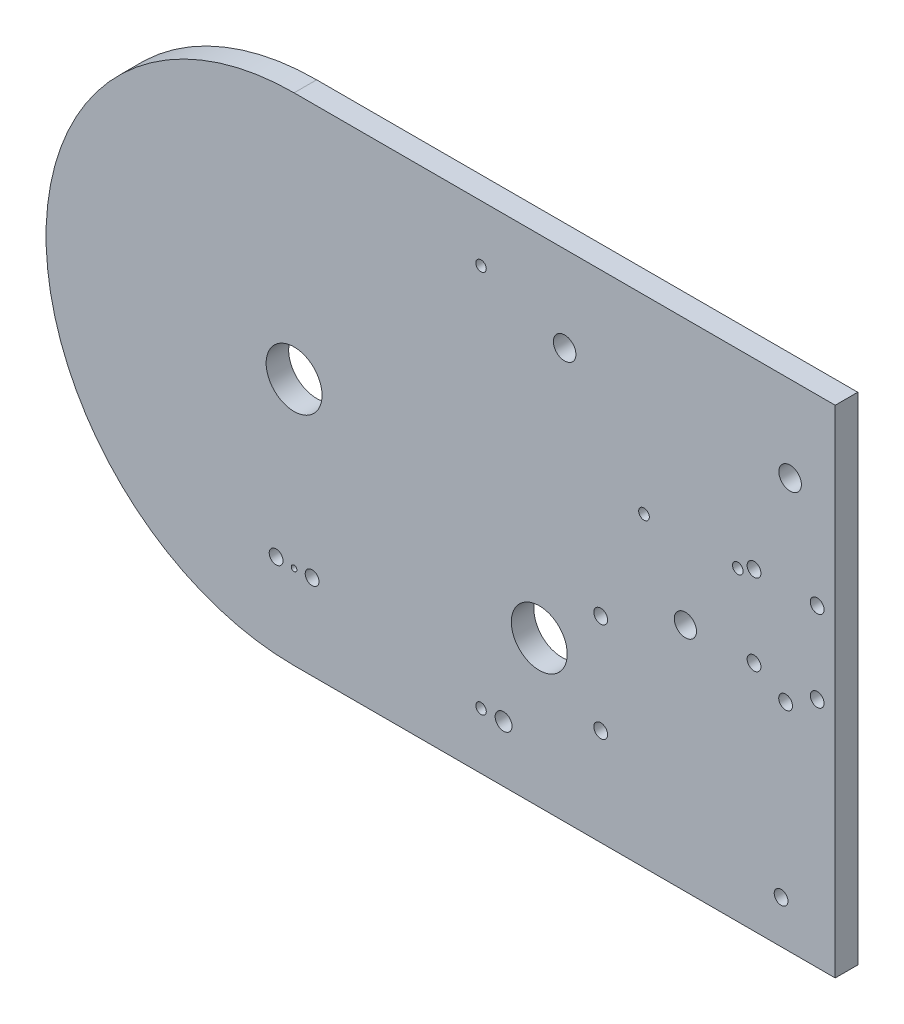
ISO-10303-21;
HEADER;
FILE_DESCRIPTION(('STEP AP214'),'2;1');
FILE_NAME('part.step','',(''),(''),'','','');
FILE_SCHEMA(('AUTOMOTIVE_DESIGN { 1 0 10303 214 1 1 1 1 }'));
ENDSEC;
DATA;
#1=APPLICATION_CONTEXT('core data for automotive mechanical design processes');
#2=APPLICATION_PROTOCOL_DEFINITION('international standard','automotive_design',2000,#1);
#3=PRODUCT_CONTEXT('',#1,'mechanical');
#4=PRODUCT('Part','Part','',(#3));
#5=PRODUCT_RELATED_PRODUCT_CATEGORY('part','',(#4));
#6=PRODUCT_DEFINITION_FORMATION('','',#4);
#7=PRODUCT_DEFINITION_CONTEXT('part definition',#1,'design');
#8=PRODUCT_DEFINITION('design','',#6,#7);
#9=PRODUCT_DEFINITION_SHAPE('','',#8);
#10=(LENGTH_UNIT() NAMED_UNIT(*) SI_UNIT(.MILLI.,.METRE.));
#11=(NAMED_UNIT(*) PLANE_ANGLE_UNIT() SI_UNIT($,.RADIAN.));
#12=(NAMED_UNIT(*) SI_UNIT($,.STERADIAN.) SOLID_ANGLE_UNIT());
#13=UNCERTAINTY_MEASURE_WITH_UNIT(LENGTH_MEASURE(1.E-05),#10,'distance_accuracy_value','');
#14=(GEOMETRIC_REPRESENTATION_CONTEXT(3) GLOBAL_UNCERTAINTY_ASSIGNED_CONTEXT((#13)) GLOBAL_UNIT_ASSIGNED_CONTEXT((#10,
#11,#12)) REPRESENTATION_CONTEXT('',''));
#15=CARTESIAN_POINT('',(0.,0.,0.));
#16=DIRECTION('',(0.,0.,1.));
#17=DIRECTION('',(1.,0.,0.));
#18=AXIS2_PLACEMENT_3D('',#15,#16,#17);
#19=CARTESIAN_POINT('',(0.,0.,6.35));
#20=DIRECTION('',(0.,0.,1.));
#21=DIRECTION('',(1.,0.,0.));
#22=AXIS2_PLACEMENT_3D('',#19,#20,#21);
#23=PLANE('',#22);
#24=CARTESIAN_POINT('',(98.5519999999999,16.382999999999,6.35));
#25=DIRECTION('',(0.,0.,1.));
#26=DIRECTION('',(1.,0.,0.));
#27=AXIS2_PLACEMENT_3D('',#24,#25,#26);
#28=CIRCLE('',#27,1.49859999999999);
#29=CARTESIAN_POINT('',(100.0506,16.382999999999,6.35));
#30=VERTEX_POINT('',#29);
#31=EDGE_CURVE('E233',#30,#30,#28,.T.);
#32=ORIENTED_EDGE('',*,*,#31,.F.);
#33=EDGE_LOOP('',(#32));
#34=FACE_BOUND('',#33,.T.);
#35=CARTESIAN_POINT('',(124.968,16.382999999999,6.35));
#36=DIRECTION('',(0.,0.,1.));
#37=DIRECTION('',(1.,0.,0.));
#38=AXIS2_PLACEMENT_3D('',#35,#36,#37);
#39=CIRCLE('',#38,1.49859999999997);
#40=CARTESIAN_POINT('',(126.4666,16.382999999999,6.35));
#41=VERTEX_POINT('',#40);
#42=EDGE_CURVE('E227',#41,#41,#39,.T.);
#43=ORIENTED_EDGE('',*,*,#42,.F.);
#44=EDGE_LOOP('',(#43));
#45=FACE_BOUND('',#44,.T.);
#46=CARTESIAN_POINT('',(59.0043258396006,-53.975,6.35));
#47=DIRECTION('',(0.,0.,1.));
#48=DIRECTION('',(1.,0.,0.));
#49=AXIS2_PLACEMENT_3D('',#46,#47,#48);
#50=CIRCLE('',#49,2.38125);
#51=CARTESIAN_POINT('',(61.3855758396006,-53.975,6.35));
#52=VERTEX_POINT('',#51);
#53=EDGE_CURVE('E221',#52,#52,#50,.T.);
#54=ORIENTED_EDGE('',*,*,#53,.F.);
#55=EDGE_LOOP('',(#54));
#56=FACE_BOUND('',#55,.T.);
#57=CARTESIAN_POINT('',(0.00594458088814826,-46.140475683147,6.35));
#58=DIRECTION('',(0.,0.,1.));
#59=DIRECTION('',(1.,0.,0.));
#60=AXIS2_PLACEMENT_3D('',#57,#58,#59);
#61=CIRCLE('',#60,0.793749999999994);
#62=CARTESIAN_POINT('',(0.799694580888142,-46.140475683147,6.35));
#63=VERTEX_POINT('',#62);
#64=EDGE_CURVE('E215',#63,#63,#61,.T.);
#65=ORIENTED_EDGE('',*,*,#64,.F.);
#66=EDGE_LOOP('',(#65));
#67=FACE_BOUND('',#66,.T.);
#68=CARTESIAN_POINT('',(129.54,18.414999999999,6.35));
#69=DIRECTION('',(0.,0.,1.));
#70=DIRECTION('',(1.,0.,0.));
#71=AXIS2_PLACEMENT_3D('',#68,#69,#70);
#72=CIRCLE('',#71,1.94309999999998);
#73=CARTESIAN_POINT('',(131.4831,18.414999999999,6.35));
#74=VERTEX_POINT('',#73);
#75=EDGE_CURVE('E209',#74,#74,#72,.T.);
#76=ORIENTED_EDGE('',*,*,#75,.F.);
#77=EDGE_LOOP('',(#76));
#78=FACE_BOUND('',#77,.T.);
#79=CARTESIAN_POINT('',(147.32,18.414999999999,6.35));
#80=DIRECTION('',(0.,0.,1.));
#81=DIRECTION('',(1.,0.,0.));
#82=AXIS2_PLACEMENT_3D('',#79,#80,#81);
#83=CIRCLE('',#82,1.94309999999998);
#84=CARTESIAN_POINT('',(149.2631,18.414999999999,6.35));
#85=VERTEX_POINT('',#84);
#86=EDGE_CURVE('E203',#85,#85,#83,.T.);
#87=ORIENTED_EDGE('',*,*,#86,.F.);
#88=EDGE_LOOP('',(#87));
#89=FACE_BOUND('',#88,.T.);
#90=CARTESIAN_POINT('',(147.32,-4.44500000000105,6.35));
#91=DIRECTION('',(0.,0.,1.));
#92=DIRECTION('',(1.,0.,0.));
#93=AXIS2_PLACEMENT_3D('',#90,#91,#92);
#94=CIRCLE('',#93,1.94309999999998);
#95=CARTESIAN_POINT('',(149.2631,-4.44500000000105,6.35));
#96=VERTEX_POINT('',#95);
#97=EDGE_CURVE('E197',#96,#96,#94,.T.);
#98=ORIENTED_EDGE('',*,*,#97,.F.);
#99=EDGE_LOOP('',(#98));
#100=FACE_BOUND('',#99,.T.);
#101=CARTESIAN_POINT('',(129.54,-4.44500000000096,6.35));
#102=DIRECTION('',(0.,0.,1.));
#103=DIRECTION('',(1.,0.,0.));
#104=AXIS2_PLACEMENT_3D('',#101,#102,#103);
#105=CIRCLE('',#104,1.94309999999998);
#106=CARTESIAN_POINT('',(131.4831,-4.44500000000096,6.35));
#107=VERTEX_POINT('',#106);
#108=EDGE_CURVE('E191',#107,#107,#105,.T.);
#109=ORIENTED_EDGE('',*,*,#108,.F.);
#110=EDGE_LOOP('',(#109));
#111=FACE_BOUND('',#110,.T.);
#112=CARTESIAN_POINT('',(138.43,-9.52500000000096,6.35));
#113=DIRECTION('',(0.,0.,1.));
#114=DIRECTION('',(1.,0.,0.));
#115=AXIS2_PLACEMENT_3D('',#112,#113,#114);
#116=CIRCLE('',#115,1.94309999999998);
#117=CARTESIAN_POINT('',(140.3731,-9.52500000000096,6.35));
#118=VERTEX_POINT('',#117);
#119=EDGE_CURVE('E185',#118,#118,#116,.T.);
#120=ORIENTED_EDGE('',*,*,#119,.F.);
#121=EDGE_LOOP('',(#120));
#122=FACE_BOUND('',#121,.T.);
#123=CARTESIAN_POINT('',(86.3599999999988,-14.6050000000013,6.35));
#124=DIRECTION('',(0.,0.,1.));
#125=DIRECTION('',(1.,0.,0.));
#126=AXIS2_PLACEMENT_3D('',#123,#124,#125);
#127=CIRCLE('',#126,1.94309999999999);
#128=CARTESIAN_POINT('',(88.3030999999988,-14.6050000000013,6.35));
#129=VERTEX_POINT('',#128);
#130=EDGE_CURVE('E179',#129,#129,#127,.T.);
#131=ORIENTED_EDGE('',*,*,#130,.F.);
#132=EDGE_LOOP('',(#131));
#133=FACE_BOUND('',#132,.T.);
#134=CARTESIAN_POINT('',(86.36,-42.5449999999997,6.35));
#135=DIRECTION('',(0.,0.,1.));
#136=DIRECTION('',(1.,0.,0.));
#137=AXIS2_PLACEMENT_3D('',#134,#135,#136);
#138=CIRCLE('',#137,1.94309999999999);
#139=CARTESIAN_POINT('',(88.3031,-42.5449999999997,6.35));
#140=VERTEX_POINT('',#139);
#141=EDGE_CURVE('E173',#140,#140,#138,.T.);
#142=ORIENTED_EDGE('',*,*,#141,.F.);
#143=EDGE_LOOP('',(#142));
#144=FACE_BOUND('',#143,.T.);
#145=CARTESIAN_POINT('',(137.16,-57.785000000001,6.35));
#146=DIRECTION('',(0.,0.,1.));
#147=DIRECTION('',(1.,0.,0.));
#148=AXIS2_PLACEMENT_3D('',#145,#146,#147);
#149=CIRCLE('',#148,1.94309999999998);
#150=CARTESIAN_POINT('',(139.1031,-57.785000000001,6.35));
#151=VERTEX_POINT('',#150);
#152=EDGE_CURVE('E167',#151,#151,#149,.T.);
#153=ORIENTED_EDGE('',*,*,#152,.F.);
#154=EDGE_LOOP('',(#153));
#155=FACE_BOUND('',#154,.T.);
#156=CARTESIAN_POINT('',(5.07324458088815,-45.872975683147,6.35));
#157=DIRECTION('',(0.,0.,1.));
#158=DIRECTION('',(1.,0.,0.));
#159=AXIS2_PLACEMENT_3D('',#156,#157,#158);
#160=CIRCLE('',#159,1.94309999999999);
#161=CARTESIAN_POINT('',(7.01634458088814,-45.872975683147,6.35));
#162=VERTEX_POINT('',#161);
#163=EDGE_CURVE('E161',#162,#162,#160,.T.);
#164=ORIENTED_EDGE('',*,*,#163,.F.);
#165=EDGE_LOOP('',(#164));
#166=FACE_BOUND('',#165,.T.);
#167=CARTESIAN_POINT('',(-5.06135541911185,-45.872975683147,6.35));
#168=DIRECTION('',(0.,0.,1.));
#169=DIRECTION('',(1.,0.,0.));
#170=AXIS2_PLACEMENT_3D('',#167,#168,#169);
#171=CIRCLE('',#170,1.94309999999999);
#172=CARTESIAN_POINT('',(-3.11825541911186,-45.872975683147,6.35));
#173=VERTEX_POINT('',#172);
#174=EDGE_CURVE('E155',#173,#173,#171,.T.);
#175=ORIENTED_EDGE('',*,*,#174,.F.);
#176=EDGE_LOOP('',(#175));
#177=FACE_BOUND('',#176,.T.);
#178=CARTESIAN_POINT('',(52.6543258396006,53.9749999999996,6.35));
#179=DIRECTION('',(0.,0.,1.));
#180=DIRECTION('',(1.,0.,0.));
#181=AXIS2_PLACEMENT_3D('',#178,#179,#180);
#182=CIRCLE('',#181,1.47319999999999);
#183=CARTESIAN_POINT('',(54.1275258396006,53.9749999999996,6.35));
#184=VERTEX_POINT('',#183);
#185=EDGE_CURVE('E149',#184,#184,#182,.T.);
#186=ORIENTED_EDGE('',*,*,#185,.F.);
#187=EDGE_LOOP('',(#186));
#188=FACE_BOUND('',#187,.T.);
#189=CARTESIAN_POINT('',(52.6543258396006,-53.975,6.35));
#190=DIRECTION('',(0.,0.,1.));
#191=DIRECTION('',(1.,0.,0.));
#192=AXIS2_PLACEMENT_3D('',#189,#190,#191);
#193=CIRCLE('',#192,1.47319999999999);
#194=CARTESIAN_POINT('',(54.1275258396006,-53.975,6.35));
#195=VERTEX_POINT('',#194);
#196=EDGE_CURVE('E143',#195,#195,#193,.T.);
#197=ORIENTED_EDGE('',*,*,#196,.F.);
#198=EDGE_LOOP('',(#197));
#199=FACE_BOUND('',#198,.T.);
#200=CARTESIAN_POINT('',(110.206805807524,-4.84362133423188,6.35));
#201=DIRECTION('',(0.,0.,1.));
#202=DIRECTION('',(1.,0.,0.));
#203=AXIS2_PLACEMENT_3D('',#200,#201,#202);
#204=CIRCLE('',#203,3.12699999999998);
#205=CARTESIAN_POINT('',(113.333805807524,-4.84362133423188,6.35));
#206=VERTEX_POINT('',#205);
#207=EDGE_CURVE('E137',#206,#206,#204,.T.);
#208=ORIENTED_EDGE('',*,*,#207,.F.);
#209=EDGE_LOOP('',(#208));
#210=FACE_BOUND('',#209,.T.);
#211=CARTESIAN_POINT('',(139.7,45.72,6.35));
#212=DIRECTION('',(0.,0.,1.));
#213=DIRECTION('',(1.,0.,0.));
#214=AXIS2_PLACEMENT_3D('',#211,#212,#213);
#215=CIRCLE('',#214,3.17499999999997);
#216=CARTESIAN_POINT('',(142.875,45.72,6.35));
#217=VERTEX_POINT('',#216);
#218=EDGE_CURVE('E131',#217,#217,#215,.T.);
#219=ORIENTED_EDGE('',*,*,#218,.F.);
#220=EDGE_LOOP('',(#219));
#221=FACE_BOUND('',#220,.T.);
#222=CARTESIAN_POINT('',(76.2,45.72,6.35));
#223=DIRECTION('',(0.,0.,1.));
#224=DIRECTION('',(1.,0.,0.));
#225=AXIS2_PLACEMENT_3D('',#222,#223,#224);
#226=CIRCLE('',#225,3.17499999999997);
#227=CARTESIAN_POINT('',(79.375,45.72,6.35));
#228=VERTEX_POINT('',#227);
#229=EDGE_CURVE('E125',#228,#228,#226,.T.);
#230=ORIENTED_EDGE('',*,*,#229,.F.);
#231=EDGE_LOOP('',(#230));
#232=FACE_BOUND('',#231,.T.);
#233=CARTESIAN_POINT('',(69.0541023726346,-28.603145740244,6.35));
#234=DIRECTION('',(0.,0.,1.));
#235=DIRECTION('',(1.,0.,0.));
#236=AXIS2_PLACEMENT_3D('',#233,#234,#235);
#237=CIRCLE('',#236,7.87399999999999);
#238=CARTESIAN_POINT('',(76.9281023726346,-28.603145740244,6.35));
#239=VERTEX_POINT('',#238);
#240=EDGE_CURVE('E99',#239,#239,#237,.T.);
#241=ORIENTED_EDGE('',*,*,#240,.F.);
#242=EDGE_LOOP('',(#241));
#243=FACE_BOUND('',#242,.T.);
#244=CARTESIAN_POINT('',(0.,0.,6.35));
#245=DIRECTION('',(0.,0.,1.));
#246=DIRECTION('',(1.,0.,0.));
#247=AXIS2_PLACEMENT_3D('',#244,#245,#246);
#248=CIRCLE('',#247,69.85);
#249=CARTESIAN_POINT('',(0.,69.85,6.35));
#250=VERTEX_POINT('',#249);
#251=CARTESIAN_POINT('',(0.,-69.85,6.35));
#252=VERTEX_POINT('',#251);
#253=EDGE_CURVE('E84',#250,#252,#248,.T.);
#254=ORIENTED_EDGE('',*,*,#253,.T.);
#255=DIRECTION('',(1.,0.,0.));
#256=VECTOR('',#255,1.);
#257=CARTESIAN_POINT('',(0.,-69.85,6.35));
#258=LINE('',#257,#256);
#259=CARTESIAN_POINT('',(152.4,-69.85,6.35));
#260=VERTEX_POINT('',#259);
#261=EDGE_CURVE('E79',#252,#260,#258,.T.);
#262=ORIENTED_EDGE('',*,*,#261,.T.);
#263=DIRECTION('',(0.,1.,0.));
#264=VECTOR('',#263,1.);
#265=CARTESIAN_POINT('',(152.4,69.85,6.35));
#266=LINE('',#265,#264);
#267=CARTESIAN_POINT('',(152.4,69.85,6.35));
#268=VERTEX_POINT('',#267);
#269=EDGE_CURVE('E82',#260,#268,#266,.T.);
#270=ORIENTED_EDGE('',*,*,#269,.T.);
#271=DIRECTION('',(-1.,0.,0.));
#272=VECTOR('',#271,1.);
#273=CARTESIAN_POINT('',(0.,69.85,6.35));
#274=LINE('',#273,#272);
#275=EDGE_CURVE('E49',#268,#250,#274,.T.);
#276=ORIENTED_EDGE('',*,*,#275,.T.);
#277=EDGE_LOOP('',(#254,#262,#270,#276));
#278=FACE_BOUND('',#277,.T.);
#279=CARTESIAN_POINT('',(0.,0.,6.35));
#280=DIRECTION('',(0.,0.,1.));
#281=DIRECTION('',(1.,0.,0.));
#282=AXIS2_PLACEMENT_3D('',#279,#280,#281);
#283=CIRCLE('',#282,7.874);
#284=CARTESIAN_POINT('',(7.874,0.,6.35));
#285=VERTEX_POINT('',#284);
#286=EDGE_CURVE('E114',#285,#285,#283,.T.);
#287=ORIENTED_EDGE('',*,*,#286,.F.);
#288=EDGE_LOOP('',(#287));
#289=FACE_BOUND('',#288,.T.);
#290=ADVANCED_FACE('F32',(#34,#45,#56,#67,#78,#89,#100,#111,#122,#133,#144,#155,#166,#177,#188,
#199,#210,#221,#232,#243,#278,#289),#23,.T.);
#291=CARTESIAN_POINT('',(0.,0.,0.));
#292=DIRECTION('',(0.,0.,1.));
#293=DIRECTION('',(1.,0.,0.));
#294=AXIS2_PLACEMENT_3D('',#291,#292,#293);
#295=PLANE('',#294);
#296=CARTESIAN_POINT('',(98.5519999999999,16.382999999999,0.));
#297=DIRECTION('',(0.,0.,1.));
#298=DIRECTION('',(1.,0.,0.));
#299=AXIS2_PLACEMENT_3D('',#296,#297,#298);
#300=CIRCLE('',#299,1.4986);
#301=CARTESIAN_POINT('',(100.0506,16.382999999999,0.));
#302=VERTEX_POINT('',#301);
#303=EDGE_CURVE('E230',#302,#302,#300,.T.);
#304=ORIENTED_EDGE('',*,*,#303,.T.);
#305=EDGE_LOOP('',(#304));
#306=FACE_BOUND('',#305,.T.);
#307=CARTESIAN_POINT('',(124.968,16.382999999999,0.));
#308=DIRECTION('',(0.,0.,1.));
#309=DIRECTION('',(1.,0.,0.));
#310=AXIS2_PLACEMENT_3D('',#307,#308,#309);
#311=CIRCLE('',#310,1.49859999999999);
#312=CARTESIAN_POINT('',(126.4666,16.382999999999,0.));
#313=VERTEX_POINT('',#312);
#314=EDGE_CURVE('E224',#313,#313,#311,.T.);
#315=ORIENTED_EDGE('',*,*,#314,.T.);
#316=EDGE_LOOP('',(#315));
#317=FACE_BOUND('',#316,.T.);
#318=CARTESIAN_POINT('',(59.0043258396006,-53.975,0.));
#319=DIRECTION('',(0.,0.,1.));
#320=DIRECTION('',(1.,0.,0.));
#321=AXIS2_PLACEMENT_3D('',#318,#319,#320);
#322=CIRCLE('',#321,2.38125);
#323=CARTESIAN_POINT('',(61.3855758396006,-53.975,0.));
#324=VERTEX_POINT('',#323);
#325=EDGE_CURVE('E218',#324,#324,#322,.F.);
#326=ORIENTED_EDGE('',*,*,#325,.F.);
#327=EDGE_LOOP('',(#326));
#328=FACE_BOUND('',#327,.T.);
#329=CARTESIAN_POINT('',(0.00594458088814826,-46.140475683147,0.));
#330=DIRECTION('',(0.,0.,1.));
#331=DIRECTION('',(1.,0.,0.));
#332=AXIS2_PLACEMENT_3D('',#329,#330,#331);
#333=CIRCLE('',#332,0.793749999999994);
#334=CARTESIAN_POINT('',(0.799694580888142,-46.140475683147,0.));
#335=VERTEX_POINT('',#334);
#336=EDGE_CURVE('E212',#335,#335,#333,.F.);
#337=ORIENTED_EDGE('',*,*,#336,.F.);
#338=EDGE_LOOP('',(#337));
#339=FACE_BOUND('',#338,.T.);
#340=CARTESIAN_POINT('',(129.54,18.414999999999,0.));
#341=DIRECTION('',(0.,0.,1.));
#342=DIRECTION('',(1.,0.,0.));
#343=AXIS2_PLACEMENT_3D('',#340,#341,#342);
#344=CIRCLE('',#343,1.94309999999999);
#345=CARTESIAN_POINT('',(131.4831,18.414999999999,0.));
#346=VERTEX_POINT('',#345);
#347=EDGE_CURVE('E206',#346,#346,#344,.T.);
#348=ORIENTED_EDGE('',*,*,#347,.T.);
#349=EDGE_LOOP('',(#348));
#350=FACE_BOUND('',#349,.T.);
#351=CARTESIAN_POINT('',(147.32,18.414999999999,0.));
#352=DIRECTION('',(0.,0.,1.));
#353=DIRECTION('',(1.,0.,0.));
#354=AXIS2_PLACEMENT_3D('',#351,#352,#353);
#355=CIRCLE('',#354,1.94309999999999);
#356=CARTESIAN_POINT('',(149.2631,18.414999999999,0.));
#357=VERTEX_POINT('',#356);
#358=EDGE_CURVE('E200',#357,#357,#355,.T.);
#359=ORIENTED_EDGE('',*,*,#358,.T.);
#360=EDGE_LOOP('',(#359));
#361=FACE_BOUND('',#360,.T.);
#362=CARTESIAN_POINT('',(147.32,-4.44500000000105,0.));
#363=DIRECTION('',(0.,0.,1.));
#364=DIRECTION('',(1.,0.,0.));
#365=AXIS2_PLACEMENT_3D('',#362,#363,#364);
#366=CIRCLE('',#365,1.94309999999999);
#367=CARTESIAN_POINT('',(149.2631,-4.44500000000105,0.));
#368=VERTEX_POINT('',#367);
#369=EDGE_CURVE('E194',#368,#368,#366,.T.);
#370=ORIENTED_EDGE('',*,*,#369,.T.);
#371=EDGE_LOOP('',(#370));
#372=FACE_BOUND('',#371,.T.);
#373=CARTESIAN_POINT('',(129.54,-4.44500000000096,0.));
#374=DIRECTION('',(0.,0.,1.));
#375=DIRECTION('',(1.,0.,0.));
#376=AXIS2_PLACEMENT_3D('',#373,#374,#375);
#377=CIRCLE('',#376,1.94309999999999);
#378=CARTESIAN_POINT('',(131.4831,-4.44500000000096,0.));
#379=VERTEX_POINT('',#378);
#380=EDGE_CURVE('E188',#379,#379,#377,.T.);
#381=ORIENTED_EDGE('',*,*,#380,.T.);
#382=EDGE_LOOP('',(#381));
#383=FACE_BOUND('',#382,.T.);
#384=CARTESIAN_POINT('',(138.43,-9.52500000000096,0.));
#385=DIRECTION('',(0.,0.,1.));
#386=DIRECTION('',(1.,0.,0.));
#387=AXIS2_PLACEMENT_3D('',#384,#385,#386);
#388=CIRCLE('',#387,1.94309999999999);
#389=CARTESIAN_POINT('',(140.3731,-9.52500000000096,0.));
#390=VERTEX_POINT('',#389);
#391=EDGE_CURVE('E182',#390,#390,#388,.T.);
#392=ORIENTED_EDGE('',*,*,#391,.T.);
#393=EDGE_LOOP('',(#392));
#394=FACE_BOUND('',#393,.T.);
#395=CARTESIAN_POINT('',(86.3599999999988,-14.6050000000013,0.));
#396=DIRECTION('',(0.,0.,1.));
#397=DIRECTION('',(1.,0.,0.));
#398=AXIS2_PLACEMENT_3D('',#395,#396,#397);
#399=CIRCLE('',#398,1.9431);
#400=CARTESIAN_POINT('',(88.3030999999988,-14.6050000000013,0.));
#401=VERTEX_POINT('',#400);
#402=EDGE_CURVE('E176',#401,#401,#399,.T.);
#403=ORIENTED_EDGE('',*,*,#402,.T.);
#404=EDGE_LOOP('',(#403));
#405=FACE_BOUND('',#404,.T.);
#406=CARTESIAN_POINT('',(86.36,-42.5449999999997,0.));
#407=DIRECTION('',(0.,0.,1.));
#408=DIRECTION('',(1.,0.,0.));
#409=AXIS2_PLACEMENT_3D('',#406,#407,#408);
#410=CIRCLE('',#409,1.9431);
#411=CARTESIAN_POINT('',(88.3031,-42.5449999999997,0.));
#412=VERTEX_POINT('',#411);
#413=EDGE_CURVE('E170',#412,#412,#410,.T.);
#414=ORIENTED_EDGE('',*,*,#413,.T.);
#415=EDGE_LOOP('',(#414));
#416=FACE_BOUND('',#415,.T.);
#417=CARTESIAN_POINT('',(137.16,-57.785000000001,0.));
#418=DIRECTION('',(0.,0.,1.));
#419=DIRECTION('',(1.,0.,0.));
#420=AXIS2_PLACEMENT_3D('',#417,#418,#419);
#421=CIRCLE('',#420,1.94309999999999);
#422=CARTESIAN_POINT('',(139.1031,-57.785000000001,0.));
#423=VERTEX_POINT('',#422);
#424=EDGE_CURVE('E164',#423,#423,#421,.T.);
#425=ORIENTED_EDGE('',*,*,#424,.T.);
#426=EDGE_LOOP('',(#425));
#427=FACE_BOUND('',#426,.T.);
#428=CARTESIAN_POINT('',(5.07324458088815,-45.872975683147,0.));
#429=DIRECTION('',(0.,0.,1.));
#430=DIRECTION('',(1.,0.,0.));
#431=AXIS2_PLACEMENT_3D('',#428,#429,#430);
#432=CIRCLE('',#431,1.94309999999999);
#433=CARTESIAN_POINT('',(7.01634458088815,-45.872975683147,0.));
#434=VERTEX_POINT('',#433);
#435=EDGE_CURVE('E158',#434,#434,#432,.T.);
#436=ORIENTED_EDGE('',*,*,#435,.T.);
#437=EDGE_LOOP('',(#436));
#438=FACE_BOUND('',#437,.T.);
#439=CARTESIAN_POINT('',(-5.06135541911185,-45.872975683147,0.));
#440=DIRECTION('',(0.,0.,1.));
#441=DIRECTION('',(1.,0.,0.));
#442=AXIS2_PLACEMENT_3D('',#439,#440,#441);
#443=CIRCLE('',#442,1.94309999999999);
#444=CARTESIAN_POINT('',(-3.11825541911185,-45.872975683147,0.));
#445=VERTEX_POINT('',#444);
#446=EDGE_CURVE('E152',#445,#445,#443,.T.);
#447=ORIENTED_EDGE('',*,*,#446,.T.);
#448=EDGE_LOOP('',(#447));
#449=FACE_BOUND('',#448,.T.);
#450=CARTESIAN_POINT('',(52.6543258396006,53.9749999999996,0.));
#451=DIRECTION('',(0.,0.,1.));
#452=DIRECTION('',(1.,0.,0.));
#453=AXIS2_PLACEMENT_3D('',#450,#451,#452);
#454=CIRCLE('',#453,1.47319999999999);
#455=CARTESIAN_POINT('',(54.1275258396006,53.9749999999996,0.));
#456=VERTEX_POINT('',#455);
#457=EDGE_CURVE('E146',#456,#456,#454,.T.);
#458=ORIENTED_EDGE('',*,*,#457,.T.);
#459=EDGE_LOOP('',(#458));
#460=FACE_BOUND('',#459,.T.);
#461=CARTESIAN_POINT('',(52.6543258396006,-53.975,0.));
#462=DIRECTION('',(0.,0.,1.));
#463=DIRECTION('',(1.,0.,0.));
#464=AXIS2_PLACEMENT_3D('',#461,#462,#463);
#465=CIRCLE('',#464,1.47319999999999);
#466=CARTESIAN_POINT('',(54.1275258396006,-53.975,0.));
#467=VERTEX_POINT('',#466);
#468=EDGE_CURVE('E140',#467,#467,#465,.T.);
#469=ORIENTED_EDGE('',*,*,#468,.T.);
#470=EDGE_LOOP('',(#469));
#471=FACE_BOUND('',#470,.T.);
#472=CARTESIAN_POINT('',(110.206805807524,-4.84362133423188,0.));
#473=DIRECTION('',(0.,0.,1.));
#474=DIRECTION('',(1.,0.,0.));
#475=AXIS2_PLACEMENT_3D('',#472,#473,#474);
#476=CIRCLE('',#475,3.12699999999998);
#477=CARTESIAN_POINT('',(113.333805807524,-4.84362133423188,0.));
#478=VERTEX_POINT('',#477);
#479=EDGE_CURVE('E134',#478,#478,#476,.F.);
#480=ORIENTED_EDGE('',*,*,#479,.F.);
#481=EDGE_LOOP('',(#480));
#482=FACE_BOUND('',#481,.T.);
#483=CARTESIAN_POINT('',(139.7,45.72,0.));
#484=DIRECTION('',(0.,0.,1.));
#485=DIRECTION('',(1.,0.,0.));
#486=AXIS2_PLACEMENT_3D('',#483,#484,#485);
#487=CIRCLE('',#486,3.17499999999997);
#488=CARTESIAN_POINT('',(142.875,45.72,0.));
#489=VERTEX_POINT('',#488);
#490=EDGE_CURVE('E128',#489,#489,#487,.F.);
#491=ORIENTED_EDGE('',*,*,#490,.F.);
#492=EDGE_LOOP('',(#491));
#493=FACE_BOUND('',#492,.T.);
#494=CARTESIAN_POINT('',(76.2,45.72,0.));
#495=DIRECTION('',(0.,0.,1.));
#496=DIRECTION('',(1.,0.,0.));
#497=AXIS2_PLACEMENT_3D('',#494,#495,#496);
#498=CIRCLE('',#497,3.17499999999997);
#499=CARTESIAN_POINT('',(79.375,45.72,0.));
#500=VERTEX_POINT('',#499);
#501=EDGE_CURVE('E120',#500,#500,#498,.F.);
#502=ORIENTED_EDGE('',*,*,#501,.F.);
#503=EDGE_LOOP('',(#502));
#504=FACE_BOUND('',#503,.T.);
#505=CARTESIAN_POINT('',(69.0541023726346,-28.603145740244,0.));
#506=DIRECTION('',(0.,0.,1.));
#507=DIRECTION('',(1.,0.,0.));
#508=AXIS2_PLACEMENT_3D('',#505,#506,#507);
#509=CIRCLE('',#508,7.87399999999999);
#510=CARTESIAN_POINT('',(76.9281023726346,-28.603145740244,0.));
#511=VERTEX_POINT('',#510);
#512=EDGE_CURVE('E111',#511,#511,#509,.T.);
#513=ORIENTED_EDGE('',*,*,#512,.T.);
#514=EDGE_LOOP('',(#513));
#515=FACE_BOUND('',#514,.T.);
#516=CARTESIAN_POINT('',(0.,0.,0.));
#517=DIRECTION('',(0.,0.,1.));
#518=DIRECTION('',(1.,0.,0.));
#519=AXIS2_PLACEMENT_3D('',#516,#517,#518);
#520=CIRCLE('',#519,69.85);
#521=CARTESIAN_POINT('',(0.,69.85,0.));
#522=VERTEX_POINT('',#521);
#523=CARTESIAN_POINT('',(0.,-69.85,0.));
#524=VERTEX_POINT('',#523);
#525=EDGE_CURVE('E96',#522,#524,#520,.T.);
#526=ORIENTED_EDGE('',*,*,#525,.F.);
#527=DIRECTION('',(-1.,0.,0.));
#528=VECTOR('',#527,1.);
#529=CARTESIAN_POINT('',(0.,69.85,0.));
#530=LINE('',#529,#528);
#531=CARTESIAN_POINT('',(152.4,69.85,0.));
#532=VERTEX_POINT('',#531);
#533=EDGE_CURVE('E72',#532,#522,#530,.T.);
#534=ORIENTED_EDGE('',*,*,#533,.F.);
#535=DIRECTION('',(0.,1.,0.));
#536=VECTOR('',#535,1.);
#537=CARTESIAN_POINT('',(152.4,69.85,0.));
#538=LINE('',#537,#536);
#539=CARTESIAN_POINT('',(152.4,-69.85,0.));
#540=VERTEX_POINT('',#539);
#541=EDGE_CURVE('E66',#540,#532,#538,.T.);
#542=ORIENTED_EDGE('',*,*,#541,.F.);
#543=DIRECTION('',(1.,0.,0.));
#544=VECTOR('',#543,1.);
#545=CARTESIAN_POINT('',(0.,-69.85,0.));
#546=LINE('',#545,#544);
#547=EDGE_CURVE('E88',#524,#540,#546,.T.);
#548=ORIENTED_EDGE('',*,*,#547,.F.);
#549=EDGE_LOOP('',(#526,#534,#542,#548));
#550=FACE_BOUND('',#549,.T.);
#551=CARTESIAN_POINT('',(0.,0.,0.));
#552=DIRECTION('',(0.,0.,1.));
#553=DIRECTION('',(1.,0.,0.));
#554=AXIS2_PLACEMENT_3D('',#551,#552,#553);
#555=CIRCLE('',#554,7.874);
#556=CARTESIAN_POINT('',(7.874,0.,0.));
#557=VERTEX_POINT('',#556);
#558=EDGE_CURVE('E117',#557,#557,#555,.T.);
#559=ORIENTED_EDGE('',*,*,#558,.T.);
#560=EDGE_LOOP('',(#559));
#561=FACE_BOUND('',#560,.T.);
#562=ADVANCED_FACE('F107',(#306,#317,#328,#339,#350,#361,#372,#383,#394,#405,#416,#427,#438,
#449,#460,#471,#482,#493,#504,#515,#550,#561),#295,.F.);
#563=CARTESIAN_POINT('',(0.,0.,6.35));
#564=DIRECTION('',(0.,0.,-1.));
#565=DIRECTION('',(-1.,0.,0.));
#566=AXIS2_PLACEMENT_3D('',#563,#564,#565);
#567=CYLINDRICAL_SURFACE('',#566,69.85);
#568=ORIENTED_EDGE('',*,*,#525,.T.);
#569=DIRECTION('',(0.,0.,-1.));
#570=VECTOR('',#569,1.);
#571=CARTESIAN_POINT('',(0.,-69.85,6.35));
#572=LINE('',#571,#570);
#573=EDGE_CURVE('E11',#252,#524,#572,.T.);
#574=ORIENTED_EDGE('',*,*,#573,.F.);
#575=ORIENTED_EDGE('',*,*,#253,.F.);
#576=DIRECTION('',(0.,0.,-1.));
#577=VECTOR('',#576,1.);
#578=CARTESIAN_POINT('',(0.,69.85,6.35));
#579=LINE('',#578,#577);
#580=EDGE_CURVE('E92',#250,#522,#579,.T.);
#581=ORIENTED_EDGE('',*,*,#580,.T.);
#582=EDGE_LOOP('',(#568,#574,#575,#581));
#583=FACE_BOUND('',#582,.T.);
#584=ADVANCED_FACE('F34',(#583),#567,.T.);
#585=CARTESIAN_POINT('',(0.,-69.85,6.35));
#586=DIRECTION('',(0.,1.,0.));
#587=DIRECTION('',(0.,0.,1.));
#588=AXIS2_PLACEMENT_3D('',#585,#586,#587);
#589=PLANE('',#588);
#590=ORIENTED_EDGE('',*,*,#547,.T.);
#591=DIRECTION('',(0.,0.,-1.));
#592=VECTOR('',#591,1.);
#593=CARTESIAN_POINT('',(152.4,-69.85,6.35));
#594=LINE('',#593,#592);
#595=EDGE_CURVE('E41',#260,#540,#594,.T.);
#596=ORIENTED_EDGE('',*,*,#595,.F.);
#597=ORIENTED_EDGE('',*,*,#261,.F.);
#598=ORIENTED_EDGE('',*,*,#573,.T.);
#599=EDGE_LOOP('',(#590,#596,#597,#598));
#600=FACE_BOUND('',#599,.T.);
#601=ADVANCED_FACE('F87',(#600),#589,.F.);
#602=CARTESIAN_POINT('',(152.4,69.85,6.35));
#603=DIRECTION('',(-1.,0.,0.));
#604=DIRECTION('',(0.,0.,1.));
#605=AXIS2_PLACEMENT_3D('',#602,#603,#604);
#606=PLANE('',#605);
#607=ORIENTED_EDGE('',*,*,#541,.T.);
#608=DIRECTION('',(0.,0.,-1.));
#609=VECTOR('',#608,1.);
#610=CARTESIAN_POINT('',(152.4,69.85,6.35));
#611=LINE('',#610,#609);
#612=EDGE_CURVE('E89',#268,#532,#611,.T.);
#613=ORIENTED_EDGE('',*,*,#612,.F.);
#614=ORIENTED_EDGE('',*,*,#269,.F.);
#615=ORIENTED_EDGE('',*,*,#595,.T.);
#616=EDGE_LOOP('',(#607,#613,#614,#615));
#617=FACE_BOUND('',#616,.T.);
#618=ADVANCED_FACE('F90',(#617),#606,.F.);
#619=CARTESIAN_POINT('',(0.,69.85,6.35));
#620=DIRECTION('',(0.,-1.,0.));
#621=DIRECTION('',(0.,0.,-1.));
#622=AXIS2_PLACEMENT_3D('',#619,#620,#621);
#623=PLANE('',#622);
#624=ORIENTED_EDGE('',*,*,#533,.T.);
#625=ORIENTED_EDGE('',*,*,#580,.F.);
#626=ORIENTED_EDGE('',*,*,#275,.F.);
#627=ORIENTED_EDGE('',*,*,#612,.T.);
#628=EDGE_LOOP('',(#624,#625,#626,#627));
#629=FACE_BOUND('',#628,.T.);
#630=ADVANCED_FACE('F104',(#629),#623,.F.);
#631=CARTESIAN_POINT('',(69.0541023726346,-28.603145740244,6.35));
#632=DIRECTION('',(0.,0.,-1.));
#633=DIRECTION('',(-1.,0.,0.));
#634=AXIS2_PLACEMENT_3D('',#631,#632,#633);
#635=CYLINDRICAL_SURFACE('',#634,7.87399999999999);
#636=ORIENTED_EDGE('',*,*,#240,.T.);
#637=EDGE_LOOP('',(#636));
#638=FACE_BOUND('',#637,.T.);
#639=ORIENTED_EDGE('',*,*,#512,.F.);
#640=EDGE_LOOP('',(#639));
#641=FACE_BOUND('',#640,.T.);
#642=ADVANCED_FACE('F280',(#638,#641),#635,.F.);
#643=CARTESIAN_POINT('',(0.,0.,6.35));
#644=DIRECTION('',(0.,0.,-1.));
#645=DIRECTION('',(-1.,0.,0.));
#646=AXIS2_PLACEMENT_3D('',#643,#644,#645);
#647=CYLINDRICAL_SURFACE('',#646,7.874);
#648=ORIENTED_EDGE('',*,*,#286,.T.);
#649=EDGE_LOOP('',(#648));
#650=FACE_BOUND('',#649,.T.);
#651=ORIENTED_EDGE('',*,*,#558,.F.);
#652=EDGE_LOOP('',(#651));
#653=FACE_BOUND('',#652,.T.);
#654=ADVANCED_FACE('F283',(#650,#653),#647,.F.);
#655=CARTESIAN_POINT('',(76.2,45.72,-0.00100000000000013));
#656=DIRECTION('',(0.,0.,1.));
#657=DIRECTION('',(1.,0.,0.));
#658=AXIS2_PLACEMENT_3D('',#655,#656,#657);
#659=CYLINDRICAL_SURFACE('',#658,3.17499999999997);
#660=ORIENTED_EDGE('',*,*,#229,.T.);
#661=EDGE_LOOP('',(#660));
#662=FACE_BOUND('',#661,.T.);
#663=ORIENTED_EDGE('',*,*,#501,.T.);
#664=EDGE_LOOP('',(#663));
#665=FACE_BOUND('',#664,.T.);
#666=ADVANCED_FACE('F321',(#662,#665),#659,.F.);
#667=CARTESIAN_POINT('',(139.7,45.72,-0.00100000000000013));
#668=DIRECTION('',(0.,0.,1.));
#669=DIRECTION('',(1.,0.,0.));
#670=AXIS2_PLACEMENT_3D('',#667,#668,#669);
#671=CYLINDRICAL_SURFACE('',#670,3.17499999999997);
#672=ORIENTED_EDGE('',*,*,#218,.T.);
#673=EDGE_LOOP('',(#672));
#674=FACE_BOUND('',#673,.T.);
#675=ORIENTED_EDGE('',*,*,#490,.T.);
#676=EDGE_LOOP('',(#675));
#677=FACE_BOUND('',#676,.T.);
#678=ADVANCED_FACE('F329',(#674,#677),#671,.F.);
#679=CARTESIAN_POINT('',(110.206805807524,-4.84362133423188,-0.00100000000000013));
#680=DIRECTION('',(0.,0.,1.));
#681=DIRECTION('',(1.,0.,0.));
#682=AXIS2_PLACEMENT_3D('',#679,#680,#681);
#683=CYLINDRICAL_SURFACE('',#682,3.12699999999998);
#684=ORIENTED_EDGE('',*,*,#207,.T.);
#685=EDGE_LOOP('',(#684));
#686=FACE_BOUND('',#685,.T.);
#687=ORIENTED_EDGE('',*,*,#479,.T.);
#688=EDGE_LOOP('',(#687));
#689=FACE_BOUND('',#688,.T.);
#690=ADVANCED_FACE('F337',(#686,#689),#683,.F.);
#691=CARTESIAN_POINT('',(52.6543258396006,-53.975,6.35));
#692=DIRECTION('',(0.,0.,1.));
#693=DIRECTION('',(1.,0.,0.));
#694=AXIS2_PLACEMENT_3D('',#691,#692,#693);
#695=CYLINDRICAL_SURFACE('',#694,1.47319999999999);
#696=ORIENTED_EDGE('',*,*,#468,.F.);
#697=EDGE_LOOP('',(#696));
#698=FACE_BOUND('',#697,.T.);
#699=ORIENTED_EDGE('',*,*,#196,.T.);
#700=EDGE_LOOP('',(#699));
#701=FACE_BOUND('',#700,.T.);
#702=ADVANCED_FACE('F345',(#698,#701),#695,.F.);
#703=CARTESIAN_POINT('',(52.6543258396006,53.9749999999996,6.35));
#704=DIRECTION('',(0.,0.,1.));
#705=DIRECTION('',(1.,0.,0.));
#706=AXIS2_PLACEMENT_3D('',#703,#704,#705);
#707=CYLINDRICAL_SURFACE('',#706,1.47319999999999);
#708=ORIENTED_EDGE('',*,*,#457,.F.);
#709=EDGE_LOOP('',(#708));
#710=FACE_BOUND('',#709,.T.);
#711=ORIENTED_EDGE('',*,*,#185,.T.);
#712=EDGE_LOOP('',(#711));
#713=FACE_BOUND('',#712,.T.);
#714=ADVANCED_FACE('F353',(#710,#713),#707,.F.);
#715=CARTESIAN_POINT('',(-5.06135541911185,-45.872975683147,6.35));
#716=DIRECTION('',(0.,0.,1.));
#717=DIRECTION('',(1.,0.,0.));
#718=AXIS2_PLACEMENT_3D('',#715,#716,#717);
#719=CYLINDRICAL_SURFACE('',#718,1.94309999999999);
#720=ORIENTED_EDGE('',*,*,#446,.F.);
#721=EDGE_LOOP('',(#720));
#722=FACE_BOUND('',#721,.T.);
#723=ORIENTED_EDGE('',*,*,#174,.T.);
#724=EDGE_LOOP('',(#723));
#725=FACE_BOUND('',#724,.T.);
#726=ADVANCED_FACE('F361',(#722,#725),#719,.F.);
#727=CARTESIAN_POINT('',(5.07324458088815,-45.872975683147,6.35));
#728=DIRECTION('',(0.,0.,1.));
#729=DIRECTION('',(1.,0.,0.));
#730=AXIS2_PLACEMENT_3D('',#727,#728,#729);
#731=CYLINDRICAL_SURFACE('',#730,1.94309999999999);
#732=ORIENTED_EDGE('',*,*,#435,.F.);
#733=EDGE_LOOP('',(#732));
#734=FACE_BOUND('',#733,.T.);
#735=ORIENTED_EDGE('',*,*,#163,.T.);
#736=EDGE_LOOP('',(#735));
#737=FACE_BOUND('',#736,.T.);
#738=ADVANCED_FACE('F369',(#734,#737),#731,.F.);
#739=CARTESIAN_POINT('',(137.16,-57.785000000001,6.35));
#740=DIRECTION('',(0.,0.,1.));
#741=DIRECTION('',(1.,0.,0.));
#742=AXIS2_PLACEMENT_3D('',#739,#740,#741);
#743=CYLINDRICAL_SURFACE('',#742,1.94309999999999);
#744=ORIENTED_EDGE('',*,*,#424,.F.);
#745=EDGE_LOOP('',(#744));
#746=FACE_BOUND('',#745,.T.);
#747=ORIENTED_EDGE('',*,*,#152,.T.);
#748=EDGE_LOOP('',(#747));
#749=FACE_BOUND('',#748,.T.);
#750=ADVANCED_FACE('F377',(#746,#749),#743,.F.);
#751=CARTESIAN_POINT('',(86.36,-42.5449999999997,6.35));
#752=DIRECTION('',(0.,0.,1.));
#753=DIRECTION('',(1.,0.,0.));
#754=AXIS2_PLACEMENT_3D('',#751,#752,#753);
#755=CYLINDRICAL_SURFACE('',#754,1.9431);
#756=ORIENTED_EDGE('',*,*,#413,.F.);
#757=EDGE_LOOP('',(#756));
#758=FACE_BOUND('',#757,.T.);
#759=ORIENTED_EDGE('',*,*,#141,.T.);
#760=EDGE_LOOP('',(#759));
#761=FACE_BOUND('',#760,.T.);
#762=ADVANCED_FACE('F385',(#758,#761),#755,.F.);
#763=CARTESIAN_POINT('',(86.3599999999988,-14.6050000000013,6.35));
#764=DIRECTION('',(0.,0.,1.));
#765=DIRECTION('',(1.,0.,0.));
#766=AXIS2_PLACEMENT_3D('',#763,#764,#765);
#767=CYLINDRICAL_SURFACE('',#766,1.9431);
#768=ORIENTED_EDGE('',*,*,#402,.F.);
#769=EDGE_LOOP('',(#768));
#770=FACE_BOUND('',#769,.T.);
#771=ORIENTED_EDGE('',*,*,#130,.T.);
#772=EDGE_LOOP('',(#771));
#773=FACE_BOUND('',#772,.T.);
#774=ADVANCED_FACE('F393',(#770,#773),#767,.F.);
#775=CARTESIAN_POINT('',(138.43,-9.52500000000096,6.35));
#776=DIRECTION('',(0.,0.,1.));
#777=DIRECTION('',(1.,0.,0.));
#778=AXIS2_PLACEMENT_3D('',#775,#776,#777);
#779=CYLINDRICAL_SURFACE('',#778,1.94309999999999);
#780=ORIENTED_EDGE('',*,*,#391,.F.);
#781=EDGE_LOOP('',(#780));
#782=FACE_BOUND('',#781,.T.);
#783=ORIENTED_EDGE('',*,*,#119,.T.);
#784=EDGE_LOOP('',(#783));
#785=FACE_BOUND('',#784,.T.);
#786=ADVANCED_FACE('F401',(#782,#785),#779,.F.);
#787=CARTESIAN_POINT('',(129.54,-4.44500000000096,6.35));
#788=DIRECTION('',(0.,0.,1.));
#789=DIRECTION('',(1.,0.,0.));
#790=AXIS2_PLACEMENT_3D('',#787,#788,#789);
#791=CYLINDRICAL_SURFACE('',#790,1.94309999999999);
#792=ORIENTED_EDGE('',*,*,#380,.F.);
#793=EDGE_LOOP('',(#792));
#794=FACE_BOUND('',#793,.T.);
#795=ORIENTED_EDGE('',*,*,#108,.T.);
#796=EDGE_LOOP('',(#795));
#797=FACE_BOUND('',#796,.T.);
#798=ADVANCED_FACE('F409',(#794,#797),#791,.F.);
#799=CARTESIAN_POINT('',(147.32,-4.44500000000105,6.35));
#800=DIRECTION('',(0.,0.,1.));
#801=DIRECTION('',(1.,0.,0.));
#802=AXIS2_PLACEMENT_3D('',#799,#800,#801);
#803=CYLINDRICAL_SURFACE('',#802,1.94309999999999);
#804=ORIENTED_EDGE('',*,*,#369,.F.);
#805=EDGE_LOOP('',(#804));
#806=FACE_BOUND('',#805,.T.);
#807=ORIENTED_EDGE('',*,*,#97,.T.);
#808=EDGE_LOOP('',(#807));
#809=FACE_BOUND('',#808,.T.);
#810=ADVANCED_FACE('F417',(#806,#809),#803,.F.);
#811=CARTESIAN_POINT('',(147.32,18.414999999999,6.35));
#812=DIRECTION('',(0.,0.,1.));
#813=DIRECTION('',(1.,0.,0.));
#814=AXIS2_PLACEMENT_3D('',#811,#812,#813);
#815=CYLINDRICAL_SURFACE('',#814,1.94309999999999);
#816=ORIENTED_EDGE('',*,*,#358,.F.);
#817=EDGE_LOOP('',(#816));
#818=FACE_BOUND('',#817,.T.);
#819=ORIENTED_EDGE('',*,*,#86,.T.);
#820=EDGE_LOOP('',(#819));
#821=FACE_BOUND('',#820,.T.);
#822=ADVANCED_FACE('F425',(#818,#821),#815,.F.);
#823=CARTESIAN_POINT('',(129.54,18.414999999999,6.35));
#824=DIRECTION('',(0.,0.,1.));
#825=DIRECTION('',(1.,0.,0.));
#826=AXIS2_PLACEMENT_3D('',#823,#824,#825);
#827=CYLINDRICAL_SURFACE('',#826,1.94309999999999);
#828=ORIENTED_EDGE('',*,*,#347,.F.);
#829=EDGE_LOOP('',(#828));
#830=FACE_BOUND('',#829,.T.);
#831=ORIENTED_EDGE('',*,*,#75,.T.);
#832=EDGE_LOOP('',(#831));
#833=FACE_BOUND('',#832,.T.);
#834=ADVANCED_FACE('F433',(#830,#833),#827,.F.);
#835=CARTESIAN_POINT('',(0.00594458088814826,-46.140475683147,-0.00100000000000013));
#836=DIRECTION('',(0.,0.,1.));
#837=DIRECTION('',(1.,0.,0.));
#838=AXIS2_PLACEMENT_3D('',#835,#836,#837);
#839=CYLINDRICAL_SURFACE('',#838,0.793749999999994);
#840=ORIENTED_EDGE('',*,*,#64,.T.);
#841=EDGE_LOOP('',(#840));
#842=FACE_BOUND('',#841,.T.);
#843=ORIENTED_EDGE('',*,*,#336,.T.);
#844=EDGE_LOOP('',(#843));
#845=FACE_BOUND('',#844,.T.);
#846=ADVANCED_FACE('F441',(#842,#845),#839,.F.);
#847=CARTESIAN_POINT('',(59.0043258396006,-53.975,-0.00100000000000013));
#848=DIRECTION('',(0.,0.,1.));
#849=DIRECTION('',(1.,0.,0.));
#850=AXIS2_PLACEMENT_3D('',#847,#848,#849);
#851=CYLINDRICAL_SURFACE('',#850,2.38125);
#852=ORIENTED_EDGE('',*,*,#53,.T.);
#853=EDGE_LOOP('',(#852));
#854=FACE_BOUND('',#853,.T.);
#855=ORIENTED_EDGE('',*,*,#325,.T.);
#856=EDGE_LOOP('',(#855));
#857=FACE_BOUND('',#856,.T.);
#858=ADVANCED_FACE('F449',(#854,#857),#851,.F.);
#859=CARTESIAN_POINT('',(124.968,16.382999999999,6.35));
#860=DIRECTION('',(0.,0.,1.));
#861=DIRECTION('',(1.,0.,0.));
#862=AXIS2_PLACEMENT_3D('',#859,#860,#861);
#863=CYLINDRICAL_SURFACE('',#862,1.49859999999999);
#864=ORIENTED_EDGE('',*,*,#314,.F.);
#865=EDGE_LOOP('',(#864));
#866=FACE_BOUND('',#865,.T.);
#867=ORIENTED_EDGE('',*,*,#42,.T.);
#868=EDGE_LOOP('',(#867));
#869=FACE_BOUND('',#868,.T.);
#870=ADVANCED_FACE('F457',(#866,#869),#863,.F.);
#871=CARTESIAN_POINT('',(98.5519999999999,16.382999999999,6.35));
#872=DIRECTION('',(0.,0.,1.));
#873=DIRECTION('',(1.,0.,0.));
#874=AXIS2_PLACEMENT_3D('',#871,#872,#873);
#875=CYLINDRICAL_SURFACE('',#874,1.4986);
#876=ORIENTED_EDGE('',*,*,#303,.F.);
#877=EDGE_LOOP('',(#876));
#878=FACE_BOUND('',#877,.T.);
#879=ORIENTED_EDGE('',*,*,#31,.T.);
#880=EDGE_LOOP('',(#879));
#881=FACE_BOUND('',#880,.T.);
#882=ADVANCED_FACE('F237',(#878,#881),#875,.F.);
#883=CLOSED_SHELL('',(#290,#562,#584,#601,#618,#630,#642,#654,#666,#678,#690,#702,#714,#726,
#738,#750,#762,#774,#786,#798,#810,#822,#834,#846,#858,#870,#882));
#884=MANIFOLD_SOLID_BREP('B2',#883);
#885=ADVANCED_BREP_SHAPE_REPRESENTATION('',(#18,#884),#14);
#886=SHAPE_DEFINITION_REPRESENTATION(#9,#885);
ENDSEC;
END-ISO-10303-21;
